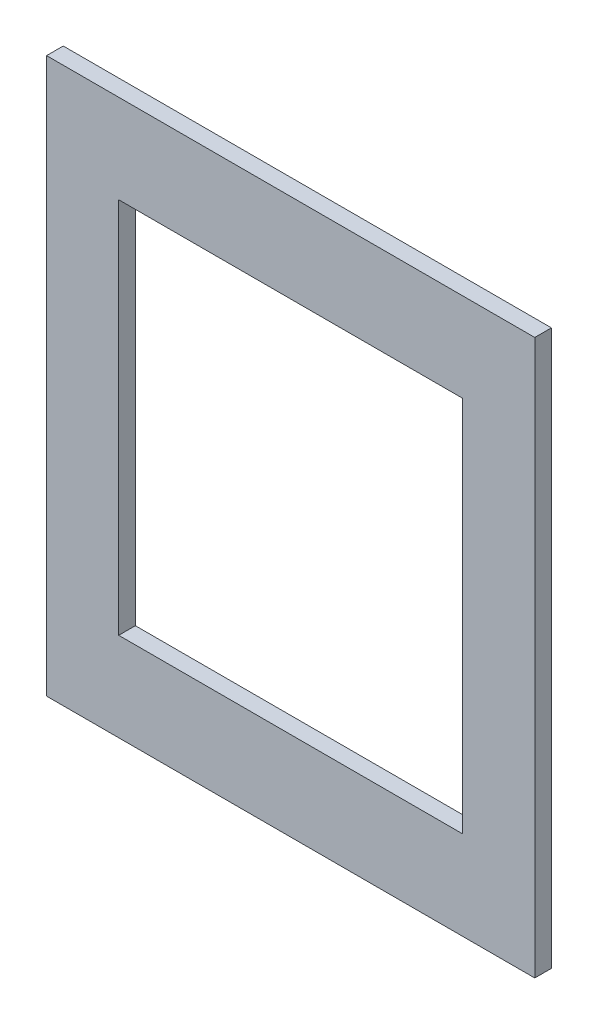
ISO-10303-21;
HEADER;
FILE_DESCRIPTION(('STEP AP214'),'2;1');
FILE_NAME('part.step','',(''),(''),'','','');
FILE_SCHEMA(('AUTOMOTIVE_DESIGN { 1 0 10303 214 1 1 1 1 }'));
ENDSEC;
DATA;
#1=APPLICATION_CONTEXT('core data for automotive mechanical design processes');
#2=APPLICATION_PROTOCOL_DEFINITION('international standard','automotive_design',2000,#1);
#3=PRODUCT_CONTEXT('',#1,'mechanical');
#4=PRODUCT('Part','Part','',(#3));
#5=PRODUCT_RELATED_PRODUCT_CATEGORY('part','',(#4));
#6=PRODUCT_DEFINITION_FORMATION('','',#4);
#7=PRODUCT_DEFINITION_CONTEXT('part definition',#1,'design');
#8=PRODUCT_DEFINITION('design','',#6,#7);
#9=PRODUCT_DEFINITION_SHAPE('','',#8);
#10=(LENGTH_UNIT() NAMED_UNIT(*) SI_UNIT(.MILLI.,.METRE.));
#11=(NAMED_UNIT(*) PLANE_ANGLE_UNIT() SI_UNIT($,.RADIAN.));
#12=(NAMED_UNIT(*) SI_UNIT($,.STERADIAN.) SOLID_ANGLE_UNIT());
#13=UNCERTAINTY_MEASURE_WITH_UNIT(LENGTH_MEASURE(1.E-05),#10,'distance_accuracy_value','');
#14=(GEOMETRIC_REPRESENTATION_CONTEXT(3) GLOBAL_UNCERTAINTY_ASSIGNED_CONTEXT((#13)) GLOBAL_UNIT_ASSIGNED_CONTEXT((#10,
#11,#12)) REPRESENTATION_CONTEXT('',''));
#15=CARTESIAN_POINT('',(0.,0.,0.));
#16=DIRECTION('',(0.,0.,1.));
#17=DIRECTION('',(1.,0.,0.));
#18=AXIS2_PLACEMENT_3D('',#15,#16,#17);
#19=CARTESIAN_POINT('',(0.,0.,1.5));
#20=DIRECTION('',(0.,0.,1.));
#21=DIRECTION('',(1.,0.,0.));
#22=AXIS2_PLACEMENT_3D('',#19,#20,#21);
#23=PLANE('',#22);
#24=DIRECTION('',(0.,1.,0.));
#25=VECTOR('',#24,1.);
#26=CARTESIAN_POINT('',(22.,25.,1.5));
#27=LINE('',#26,#25);
#28=CARTESIAN_POINT('',(22.,-25.,1.5));
#29=VERTEX_POINT('',#28);
#30=CARTESIAN_POINT('',(22.,25.,1.5));
#31=VERTEX_POINT('',#30);
#32=EDGE_CURVE('E150',#29,#31,#27,.T.);
#33=ORIENTED_EDGE('',*,*,#32,.T.);
#34=DIRECTION('',(-1.,0.,0.));
#35=VECTOR('',#34,1.);
#36=CARTESIAN_POINT('',(-22.,25.,1.5));
#37=LINE('',#36,#35);
#38=CARTESIAN_POINT('',(-22.,25.,1.5));
#39=VERTEX_POINT('',#38);
#40=EDGE_CURVE('E155',#31,#39,#37,.T.);
#41=ORIENTED_EDGE('',*,*,#40,.T.);
#42=DIRECTION('',(0.,-1.,0.));
#43=VECTOR('',#42,1.);
#44=CARTESIAN_POINT('',(-22.,25.,1.5));
#45=LINE('',#44,#43);
#46=CARTESIAN_POINT('',(-22.,-25.,1.5));
#47=VERTEX_POINT('',#46);
#48=EDGE_CURVE('E161',#39,#47,#45,.T.);
#49=ORIENTED_EDGE('',*,*,#48,.T.);
#50=DIRECTION('',(1.,0.,0.));
#51=VECTOR('',#50,1.);
#52=CARTESIAN_POINT('',(-22.,-25.,1.5));
#53=LINE('',#52,#51);
#54=EDGE_CURVE('E164',#47,#29,#53,.T.);
#55=ORIENTED_EDGE('',*,*,#54,.T.);
#56=EDGE_LOOP('',(#33,#41,#49,#55));
#57=FACE_BOUND('',#56,.T.);
#58=DIRECTION('',(-1.,0.,0.));
#59=VECTOR('',#58,1.);
#60=CARTESIAN_POINT('',(-15.5,17.,1.5));
#61=LINE('',#60,#59);
#62=CARTESIAN_POINT('',(15.5,17.,1.5));
#63=VERTEX_POINT('',#62);
#64=CARTESIAN_POINT('',(-15.5,17.,1.5));
#65=VERTEX_POINT('',#64);
#66=EDGE_CURVE('E110',#63,#65,#61,.T.);
#67=ORIENTED_EDGE('',*,*,#66,.F.);
#68=DIRECTION('',(0.,1.,0.));
#69=VECTOR('',#68,1.);
#70=CARTESIAN_POINT('',(15.5,17.,1.5));
#71=LINE('',#70,#69);
#72=CARTESIAN_POINT('',(15.5,-17.,1.5));
#73=VERTEX_POINT('',#72);
#74=EDGE_CURVE('E101',#73,#63,#71,.T.);
#75=ORIENTED_EDGE('',*,*,#74,.F.);
#76=DIRECTION('',(1.,0.,0.));
#77=VECTOR('',#76,1.);
#78=CARTESIAN_POINT('',(-15.5,-17.,1.5));
#79=LINE('',#78,#77);
#80=CARTESIAN_POINT('',(-15.5,-17.,1.5));
#81=VERTEX_POINT('',#80);
#82=EDGE_CURVE('E127',#81,#73,#79,.T.);
#83=ORIENTED_EDGE('',*,*,#82,.F.);
#84=DIRECTION('',(0.,-1.,0.));
#85=VECTOR('',#84,1.);
#86=CARTESIAN_POINT('',(-15.5,17.,1.5));
#87=LINE('',#86,#85);
#88=EDGE_CURVE('E122',#65,#81,#87,.T.);
#89=ORIENTED_EDGE('',*,*,#88,.F.);
#90=EDGE_LOOP('',(#67,#75,#83,#89));
#91=FACE_BOUND('',#90,.T.);
#92=ADVANCED_FACE('F36',(#57,#91),#23,.T.);
#93=CARTESIAN_POINT('',(0.,0.,0.));
#94=DIRECTION('',(0.,0.,1.));
#95=DIRECTION('',(1.,0.,0.));
#96=AXIS2_PLACEMENT_3D('',#93,#94,#95);
#97=PLANE('',#96);
#98=DIRECTION('',(0.,1.,0.));
#99=VECTOR('',#98,1.);
#100=CARTESIAN_POINT('',(22.,25.,0.));
#101=LINE('',#100,#99);
#102=CARTESIAN_POINT('',(22.,-25.,0.));
#103=VERTEX_POINT('',#102);
#104=CARTESIAN_POINT('',(22.,25.,0.));
#105=VERTEX_POINT('',#104);
#106=EDGE_CURVE('E118',#103,#105,#101,.T.);
#107=ORIENTED_EDGE('',*,*,#106,.F.);
#108=DIRECTION('',(1.,0.,0.));
#109=VECTOR('',#108,1.);
#110=CARTESIAN_POINT('',(-22.,-25.,0.));
#111=LINE('',#110,#109);
#112=CARTESIAN_POINT('',(-22.,-25.,0.));
#113=VERTEX_POINT('',#112);
#114=EDGE_CURVE('E156',#113,#103,#111,.T.);
#115=ORIENTED_EDGE('',*,*,#114,.F.);
#116=DIRECTION('',(0.,-1.,0.));
#117=VECTOR('',#116,1.);
#118=CARTESIAN_POINT('',(-22.,25.,0.));
#119=LINE('',#118,#117);
#120=CARTESIAN_POINT('',(-22.,25.,0.));
#121=VERTEX_POINT('',#120);
#122=EDGE_CURVE('E172',#121,#113,#119,.T.);
#123=ORIENTED_EDGE('',*,*,#122,.F.);
#124=DIRECTION('',(-1.,0.,0.));
#125=VECTOR('',#124,1.);
#126=CARTESIAN_POINT('',(-22.,25.,0.));
#127=LINE('',#126,#125);
#128=EDGE_CURVE('E170',#105,#121,#127,.T.);
#129=ORIENTED_EDGE('',*,*,#128,.F.);
#130=EDGE_LOOP('',(#107,#115,#123,#129));
#131=FACE_BOUND('',#130,.T.);
#132=DIRECTION('',(0.,1.,0.));
#133=VECTOR('',#132,1.);
#134=CARTESIAN_POINT('',(15.5,17.,0.));
#135=LINE('',#134,#133);
#136=CARTESIAN_POINT('',(15.5,-17.,0.));
#137=VERTEX_POINT('',#136);
#138=CARTESIAN_POINT('',(15.5,17.,0.));
#139=VERTEX_POINT('',#138);
#140=EDGE_CURVE('E59',#137,#139,#135,.T.);
#141=ORIENTED_EDGE('',*,*,#140,.T.);
#142=DIRECTION('',(-1.,0.,0.));
#143=VECTOR('',#142,1.);
#144=CARTESIAN_POINT('',(-15.5,17.,0.));
#145=LINE('',#144,#143);
#146=CARTESIAN_POINT('',(-15.5,17.,0.));
#147=VERTEX_POINT('',#146);
#148=EDGE_CURVE('E117',#139,#147,#145,.T.);
#149=ORIENTED_EDGE('',*,*,#148,.T.);
#150=DIRECTION('',(0.,-1.,0.));
#151=VECTOR('',#150,1.);
#152=CARTESIAN_POINT('',(-15.5,17.,0.));
#153=LINE('',#152,#151);
#154=CARTESIAN_POINT('',(-15.5,-17.,0.));
#155=VERTEX_POINT('',#154);
#156=EDGE_CURVE('E142',#147,#155,#153,.T.);
#157=ORIENTED_EDGE('',*,*,#156,.T.);
#158=DIRECTION('',(1.,0.,0.));
#159=VECTOR('',#158,1.);
#160=CARTESIAN_POINT('',(-15.5,-17.,0.));
#161=LINE('',#160,#159);
#162=EDGE_CURVE('E111',#155,#137,#161,.T.);
#163=ORIENTED_EDGE('',*,*,#162,.T.);
#164=EDGE_LOOP('',(#141,#149,#157,#163));
#165=FACE_BOUND('',#164,.T.);
#166=ADVANCED_FACE('F190',(#131,#165),#97,.F.);
#167=CARTESIAN_POINT('',(22.,25.,1.5));
#168=DIRECTION('',(-1.,0.,0.));
#169=DIRECTION('',(0.,-1.,0.));
#170=AXIS2_PLACEMENT_3D('',#167,#168,#169);
#171=PLANE('',#170);
#172=ORIENTED_EDGE('',*,*,#106,.T.);
#173=DIRECTION('',(0.,0.,-1.));
#174=VECTOR('',#173,1.);
#175=CARTESIAN_POINT('',(22.,25.,1.5));
#176=LINE('',#175,#174);
#177=EDGE_CURVE('E12',#31,#105,#176,.T.);
#178=ORIENTED_EDGE('',*,*,#177,.F.);
#179=ORIENTED_EDGE('',*,*,#32,.F.);
#180=DIRECTION('',(0.,0.,-1.));
#181=VECTOR('',#180,1.);
#182=CARTESIAN_POINT('',(22.,-25.,1.5));
#183=LINE('',#182,#181);
#184=EDGE_CURVE('E167',#29,#103,#183,.T.);
#185=ORIENTED_EDGE('',*,*,#184,.T.);
#186=EDGE_LOOP('',(#172,#178,#179,#185));
#187=FACE_BOUND('',#186,.T.);
#188=ADVANCED_FACE('F38',(#187),#171,.F.);
#189=CARTESIAN_POINT('',(-22.,25.,1.5));
#190=DIRECTION('',(0.,-1.,0.));
#191=DIRECTION('',(1.,0.,0.));
#192=AXIS2_PLACEMENT_3D('',#189,#190,#191);
#193=PLANE('',#192);
#194=ORIENTED_EDGE('',*,*,#128,.T.);
#195=DIRECTION('',(0.,0.,-1.));
#196=VECTOR('',#195,1.);
#197=CARTESIAN_POINT('',(-22.,25.,1.5));
#198=LINE('',#197,#196);
#199=EDGE_CURVE('E44',#39,#121,#198,.T.);
#200=ORIENTED_EDGE('',*,*,#199,.F.);
#201=ORIENTED_EDGE('',*,*,#40,.F.);
#202=ORIENTED_EDGE('',*,*,#177,.T.);
#203=EDGE_LOOP('',(#194,#200,#201,#202));
#204=FACE_BOUND('',#203,.T.);
#205=ADVANCED_FACE('F201',(#204),#193,.F.);
#206=CARTESIAN_POINT('',(-22.,25.,1.5));
#207=DIRECTION('',(1.,0.,0.));
#208=DIRECTION('',(0.,1.,0.));
#209=AXIS2_PLACEMENT_3D('',#206,#207,#208);
#210=PLANE('',#209);
#211=ORIENTED_EDGE('',*,*,#122,.T.);
#212=DIRECTION('',(0.,0.,-1.));
#213=VECTOR('',#212,1.);
#214=CARTESIAN_POINT('',(-22.,-25.,1.5));
#215=LINE('',#214,#213);
#216=EDGE_CURVE('E177',#47,#113,#215,.T.);
#217=ORIENTED_EDGE('',*,*,#216,.F.);
#218=ORIENTED_EDGE('',*,*,#48,.F.);
#219=ORIENTED_EDGE('',*,*,#199,.T.);
#220=EDGE_LOOP('',(#211,#217,#218,#219));
#221=FACE_BOUND('',#220,.T.);
#222=ADVANCED_FACE('F184',(#221),#210,.F.);
#223=CARTESIAN_POINT('',(-22.,-25.,1.5));
#224=DIRECTION('',(0.,1.,0.));
#225=DIRECTION('',(0.,0.,1.));
#226=AXIS2_PLACEMENT_3D('',#223,#224,#225);
#227=PLANE('',#226);
#228=ORIENTED_EDGE('',*,*,#114,.T.);
#229=ORIENTED_EDGE('',*,*,#184,.F.);
#230=ORIENTED_EDGE('',*,*,#54,.F.);
#231=ORIENTED_EDGE('',*,*,#216,.T.);
#232=EDGE_LOOP('',(#228,#229,#230,#231));
#233=FACE_BOUND('',#232,.T.);
#234=ADVANCED_FACE('F194',(#233),#227,.F.);
#235=CARTESIAN_POINT('',(15.5,17.,1.5));
#236=DIRECTION('',(-1.,0.,0.));
#237=DIRECTION('',(0.,0.,1.));
#238=AXIS2_PLACEMENT_3D('',#235,#236,#237);
#239=PLANE('',#238);
#240=ORIENTED_EDGE('',*,*,#140,.F.);
#241=DIRECTION('',(0.,0.,-1.));
#242=VECTOR('',#241,1.);
#243=CARTESIAN_POINT('',(15.5,-17.,1.5));
#244=LINE('',#243,#242);
#245=EDGE_CURVE('E105',#73,#137,#244,.T.);
#246=ORIENTED_EDGE('',*,*,#245,.F.);
#247=ORIENTED_EDGE('',*,*,#74,.T.);
#248=DIRECTION('',(0.,0.,-1.));
#249=VECTOR('',#248,1.);
#250=CARTESIAN_POINT('',(15.5,17.,1.5));
#251=LINE('',#250,#249);
#252=EDGE_CURVE('E104',#63,#139,#251,.T.);
#253=ORIENTED_EDGE('',*,*,#252,.T.);
#254=EDGE_LOOP('',(#240,#246,#247,#253));
#255=FACE_BOUND('',#254,.T.);
#256=ADVANCED_FACE('F103',(#255),#239,.T.);
#257=CARTESIAN_POINT('',(-15.5,17.,1.5));
#258=DIRECTION('',(0.,-1.,0.));
#259=DIRECTION('',(0.,0.,-1.));
#260=AXIS2_PLACEMENT_3D('',#257,#258,#259);
#261=PLANE('',#260);
#262=ORIENTED_EDGE('',*,*,#148,.F.);
#263=ORIENTED_EDGE('',*,*,#252,.F.);
#264=ORIENTED_EDGE('',*,*,#66,.T.);
#265=DIRECTION('',(0.,0.,-1.));
#266=VECTOR('',#265,1.);
#267=CARTESIAN_POINT('',(-15.5,17.,1.5));
#268=LINE('',#267,#266);
#269=EDGE_CURVE('E119',#65,#147,#268,.T.);
#270=ORIENTED_EDGE('',*,*,#269,.T.);
#271=EDGE_LOOP('',(#262,#263,#264,#270));
#272=FACE_BOUND('',#271,.T.);
#273=ADVANCED_FACE('F114',(#272),#261,.T.);
#274=CARTESIAN_POINT('',(-15.5,17.,1.5));
#275=DIRECTION('',(1.,0.,0.));
#276=DIRECTION('',(0.,0.,-1.));
#277=AXIS2_PLACEMENT_3D('',#274,#275,#276);
#278=PLANE('',#277);
#279=ORIENTED_EDGE('',*,*,#156,.F.);
#280=ORIENTED_EDGE('',*,*,#269,.F.);
#281=ORIENTED_EDGE('',*,*,#88,.T.);
#282=DIRECTION('',(0.,0.,-1.));
#283=VECTOR('',#282,1.);
#284=CARTESIAN_POINT('',(-15.5,-17.,1.5));
#285=LINE('',#284,#283);
#286=EDGE_CURVE('E51',#81,#155,#285,.T.);
#287=ORIENTED_EDGE('',*,*,#286,.T.);
#288=EDGE_LOOP('',(#279,#280,#281,#287));
#289=FACE_BOUND('',#288,.T.);
#290=ADVANCED_FACE('F224',(#289),#278,.T.);
#291=CARTESIAN_POINT('',(-15.5,-17.,1.5));
#292=DIRECTION('',(0.,1.,0.));
#293=DIRECTION('',(0.,0.,1.));
#294=AXIS2_PLACEMENT_3D('',#291,#292,#293);
#295=PLANE('',#294);
#296=ORIENTED_EDGE('',*,*,#162,.F.);
#297=ORIENTED_EDGE('',*,*,#286,.F.);
#298=ORIENTED_EDGE('',*,*,#82,.T.);
#299=ORIENTED_EDGE('',*,*,#245,.T.);
#300=EDGE_LOOP('',(#296,#297,#298,#299));
#301=FACE_BOUND('',#300,.T.);
#302=ADVANCED_FACE('F228',(#301),#295,.T.);
#303=CLOSED_SHELL('',(#92,#166,#188,#205,#222,#234,#256,#273,#290,#302));
#304=MANIFOLD_SOLID_BREP('B2',#303);
#305=ADVANCED_BREP_SHAPE_REPRESENTATION('',(#18,#304),#14);
#306=SHAPE_DEFINITION_REPRESENTATION(#9,#305);
ENDSEC;
END-ISO-10303-21;
